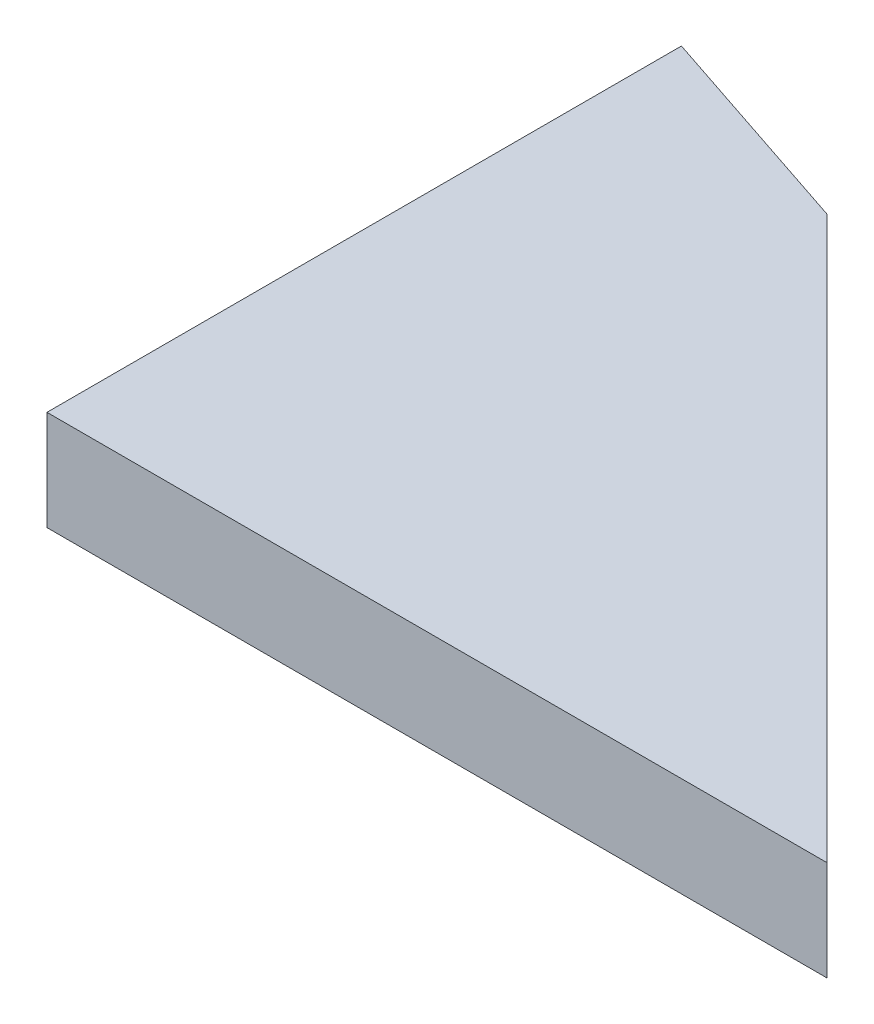
ISO-10303-21;
HEADER;
FILE_DESCRIPTION(('STEP AP214'),'2;1');
FILE_NAME('part.step','',(''),(''),'','','');
FILE_SCHEMA(('AUTOMOTIVE_DESIGN { 1 0 10303 214 1 1 1 1 }'));
ENDSEC;
DATA;
#1=APPLICATION_CONTEXT('core data for automotive mechanical design processes');
#2=APPLICATION_PROTOCOL_DEFINITION('international standard','automotive_design',2000,#1);
#3=PRODUCT_CONTEXT('',#1,'mechanical');
#4=PRODUCT('Part','Part','',(#3));
#5=PRODUCT_RELATED_PRODUCT_CATEGORY('part','',(#4));
#6=PRODUCT_DEFINITION_FORMATION('','',#4);
#7=PRODUCT_DEFINITION_CONTEXT('part definition',#1,'design');
#8=PRODUCT_DEFINITION('design','',#6,#7);
#9=PRODUCT_DEFINITION_SHAPE('','',#8);
#10=(LENGTH_UNIT() NAMED_UNIT(*) SI_UNIT(.MILLI.,.METRE.));
#11=(NAMED_UNIT(*) PLANE_ANGLE_UNIT() SI_UNIT($,.RADIAN.));
#12=(NAMED_UNIT(*) SI_UNIT($,.STERADIAN.) SOLID_ANGLE_UNIT());
#13=UNCERTAINTY_MEASURE_WITH_UNIT(LENGTH_MEASURE(1.E-05),#10,'distance_accuracy_value','');
#14=(GEOMETRIC_REPRESENTATION_CONTEXT(3) GLOBAL_UNCERTAINTY_ASSIGNED_CONTEXT((#13)) GLOBAL_UNIT_ASSIGNED_CONTEXT((#10,
#11,#12)) REPRESENTATION_CONTEXT('',''));
#15=CARTESIAN_POINT('',(0.,0.,0.));
#16=DIRECTION('',(0.,0.,1.));
#17=DIRECTION('',(1.,0.,0.));
#18=AXIS2_PLACEMENT_3D('',#15,#16,#17);
#19=CARTESIAN_POINT('',(17.2000000000003,6.4,-51.6000000000001));
#20=DIRECTION('',(0.316227766016841,0.,-0.948683298050513));
#21=DIRECTION('',(-0.948683298050513,0.,-0.316227766016841));
#22=AXIS2_PLACEMENT_3D('',#19,#20,#21);
#23=PLANE('',#22);
#24=DIRECTION('',(0.948683298050513,0.,0.316227766016841));
#25=VECTOR('',#24,1.);
#26=CARTESIAN_POINT('',(17.2000000000003,0.,-51.6000000000001));
#27=LINE('',#26,#25);
#28=CARTESIAN_POINT('',(50.,0.,-40.6666666666668));
#29=VERTEX_POINT('',#28);
#30=CARTESIAN_POINT('',(64.0000000000001,0.,-36.));
#31=VERTEX_POINT('',#30);
#32=EDGE_CURVE('E98',#29,#31,#27,.T.);
#33=ORIENTED_EDGE('',*,*,#32,.F.);
#34=DIRECTION('',(0.,-1.,0.));
#35=VECTOR('',#34,1.);
#36=CARTESIAN_POINT('',(50.,6.4,-40.6666666666668));
#37=LINE('',#36,#35);
#38=CARTESIAN_POINT('',(50.,6.4,-40.6666666666668));
#39=VERTEX_POINT('',#38);
#40=EDGE_CURVE('E11',#39,#29,#37,.T.);
#41=ORIENTED_EDGE('',*,*,#40,.F.);
#42=DIRECTION('',(0.948683298050513,0.,0.316227766016841));
#43=VECTOR('',#42,1.);
#44=CARTESIAN_POINT('',(17.2000000000003,6.4,-51.6000000000001));
#45=LINE('',#44,#43);
#46=CARTESIAN_POINT('',(64.0000000000001,6.4,-36.));
#47=VERTEX_POINT('',#46);
#48=EDGE_CURVE('E83',#39,#47,#45,.T.);
#49=ORIENTED_EDGE('',*,*,#48,.T.);
#50=DIRECTION('',(0.,-1.,0.));
#51=VECTOR('',#50,1.);
#52=CARTESIAN_POINT('',(64.0000000000001,6.4,-36.));
#53=LINE('',#52,#51);
#54=EDGE_CURVE('E51',#47,#31,#53,.T.);
#55=ORIENTED_EDGE('',*,*,#54,.T.);
#56=EDGE_LOOP('',(#33,#41,#49,#55));
#57=FACE_BOUND('',#56,.T.);
#58=ADVANCED_FACE('F35',(#57),#23,.T.);
#59=CARTESIAN_POINT('',(50.,6.4,0.));
#60=DIRECTION('',(1.,0.,0.));
#61=DIRECTION('',(0.,0.,-1.));
#62=AXIS2_PLACEMENT_3D('',#59,#60,#61);
#63=PLANE('',#62);
#64=DIRECTION('',(0.,0.,1.));
#65=VECTOR('',#64,1.);
#66=CARTESIAN_POINT('',(50.,0.,0.));
#67=LINE('',#66,#65);
#68=CARTESIAN_POINT('',(50.,0.,0.));
#69=VERTEX_POINT('',#68);
#70=EDGE_CURVE('E89',#29,#69,#67,.T.);
#71=ORIENTED_EDGE('',*,*,#70,.T.);
#72=DIRECTION('',(0.,-1.,0.));
#73=VECTOR('',#72,1.);
#74=CARTESIAN_POINT('',(50.,6.4,0.));
#75=LINE('',#74,#73);
#76=CARTESIAN_POINT('',(50.,6.4,0.));
#77=VERTEX_POINT('',#76);
#78=EDGE_CURVE('E43',#77,#69,#75,.T.);
#79=ORIENTED_EDGE('',*,*,#78,.F.);
#80=DIRECTION('',(0.,0.,1.));
#81=VECTOR('',#80,1.);
#82=CARTESIAN_POINT('',(50.,6.4,0.));
#83=LINE('',#82,#81);
#84=EDGE_CURVE('E77',#39,#77,#83,.T.);
#85=ORIENTED_EDGE('',*,*,#84,.F.);
#86=ORIENTED_EDGE('',*,*,#40,.T.);
#87=EDGE_LOOP('',(#71,#79,#85,#86));
#88=FACE_BOUND('',#87,.T.);
#89=ADVANCED_FACE('F87',(#88),#63,.F.);
#90=CARTESIAN_POINT('',(0.,6.4,0.));
#91=DIRECTION('',(0.,0.,-1.));
#92=DIRECTION('',(-1.,0.,0.));
#93=AXIS2_PLACEMENT_3D('',#90,#91,#92);
#94=PLANE('',#93);
#95=DIRECTION('',(1.,0.,0.));
#96=VECTOR('',#95,1.);
#97=CARTESIAN_POINT('',(0.,0.,0.));
#98=LINE('',#97,#96);
#99=CARTESIAN_POINT('',(100.,0.,0.));
#100=VERTEX_POINT('',#99);
#101=EDGE_CURVE('E101',#69,#100,#98,.T.);
#102=ORIENTED_EDGE('',*,*,#101,.T.);
#103=DIRECTION('',(0.,-1.,0.));
#104=VECTOR('',#103,1.);
#105=CARTESIAN_POINT('',(100.,6.4,0.));
#106=LINE('',#105,#104);
#107=CARTESIAN_POINT('',(100.,6.4,0.));
#108=VERTEX_POINT('',#107);
#109=EDGE_CURVE('E65',#108,#100,#106,.T.);
#110=ORIENTED_EDGE('',*,*,#109,.F.);
#111=DIRECTION('',(1.,0.,0.));
#112=VECTOR('',#111,1.);
#113=CARTESIAN_POINT('',(0.,6.4,0.));
#114=LINE('',#113,#112);
#115=EDGE_CURVE('E82',#77,#108,#114,.T.);
#116=ORIENTED_EDGE('',*,*,#115,.F.);
#117=ORIENTED_EDGE('',*,*,#78,.T.);
#118=EDGE_LOOP('',(#102,#110,#116,#117));
#119=FACE_BOUND('',#118,.T.);
#120=ADVANCED_FACE('F92',(#119),#94,.F.);
#121=CARTESIAN_POINT('',(50.0000000000002,6.4,-50.));
#122=DIRECTION('',(0.707106781186549,0.,-0.707106781186546));
#123=DIRECTION('',(-0.707106781186546,0.,-0.707106781186549));
#124=AXIS2_PLACEMENT_3D('',#121,#122,#123);
#125=PLANE('',#124);
#126=DIRECTION('',(0.707106781186546,0.,0.707106781186549));
#127=VECTOR('',#126,1.);
#128=CARTESIAN_POINT('',(50.0000000000002,0.,-50.));
#129=LINE('',#128,#127);
#130=EDGE_CURVE('E103',#31,#100,#129,.T.);
#131=ORIENTED_EDGE('',*,*,#130,.F.);
#132=ORIENTED_EDGE('',*,*,#54,.F.);
#133=DIRECTION('',(0.707106781186546,0.,0.707106781186549));
#134=VECTOR('',#133,1.);
#135=CARTESIAN_POINT('',(50.0000000000002,6.4,-50.));
#136=LINE('',#135,#134);
#137=EDGE_CURVE('E93',#47,#108,#136,.T.);
#138=ORIENTED_EDGE('',*,*,#137,.T.);
#139=ORIENTED_EDGE('',*,*,#109,.T.);
#140=EDGE_LOOP('',(#131,#132,#138,#139));
#141=FACE_BOUND('',#140,.T.);
#142=ADVANCED_FACE('F108',(#141),#125,.T.);
#143=CARTESIAN_POINT('',(0.,6.4,0.));
#144=DIRECTION('',(0.,1.,0.));
#145=DIRECTION('',(0.,0.,1.));
#146=AXIS2_PLACEMENT_3D('',#143,#144,#145);
#147=PLANE('',#146);
#148=ORIENTED_EDGE('',*,*,#48,.F.);
#149=ORIENTED_EDGE('',*,*,#84,.T.);
#150=ORIENTED_EDGE('',*,*,#115,.T.);
#151=ORIENTED_EDGE('',*,*,#137,.F.);
#152=EDGE_LOOP('',(#148,#149,#150,#151));
#153=FACE_BOUND('',#152,.T.);
#154=ADVANCED_FACE('F79',(#153),#147,.T.);
#155=CARTESIAN_POINT('',(0.,0.,0.));
#156=DIRECTION('',(0.,1.,0.));
#157=DIRECTION('',(0.,0.,1.));
#158=AXIS2_PLACEMENT_3D('',#155,#156,#157);
#159=PLANE('',#158);
#160=ORIENTED_EDGE('',*,*,#32,.T.);
#161=ORIENTED_EDGE('',*,*,#130,.T.);
#162=ORIENTED_EDGE('',*,*,#101,.F.);
#163=ORIENTED_EDGE('',*,*,#70,.F.);
#164=EDGE_LOOP('',(#160,#161,#162,#163));
#165=FACE_BOUND('',#164,.T.);
#166=ADVANCED_FACE('F115',(#165),#159,.F.);
#167=CLOSED_SHELL('',(#58,#89,#120,#142,#154,#166));
#168=MANIFOLD_SOLID_BREP('B2',#167);
#169=ADVANCED_BREP_SHAPE_REPRESENTATION('',(#18,#168),#14);
#170=SHAPE_DEFINITION_REPRESENTATION(#9,#169);
ENDSEC;
END-ISO-10303-21;
